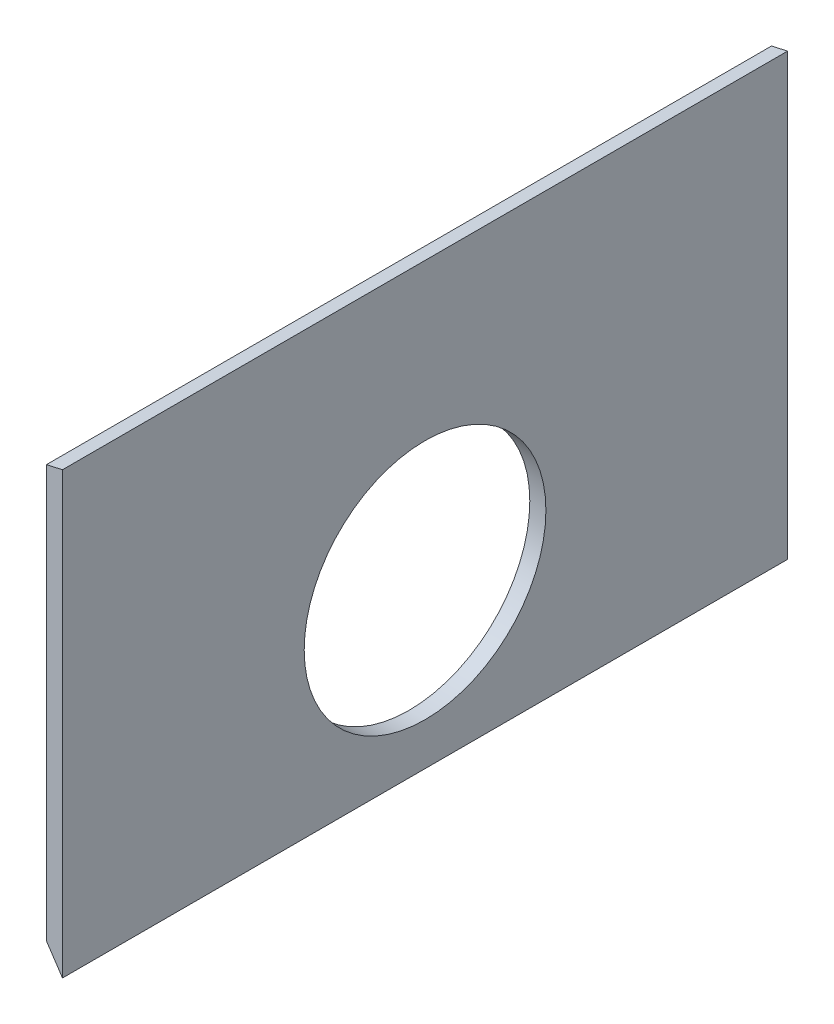
ISO-10303-21;
HEADER;
FILE_DESCRIPTION(('STEP AP214'),'2;1');
FILE_NAME('part.step','',(''),(''),'','','');
FILE_SCHEMA(('AUTOMOTIVE_DESIGN { 1 0 10303 214 1 1 1 1 }'));
ENDSEC;
DATA;
#1=APPLICATION_CONTEXT('core data for automotive mechanical design processes');
#2=APPLICATION_PROTOCOL_DEFINITION('international standard','automotive_design',2000,#1);
#3=PRODUCT_CONTEXT('',#1,'mechanical');
#4=PRODUCT('Part','Part','',(#3));
#5=PRODUCT_RELATED_PRODUCT_CATEGORY('part','',(#4));
#6=PRODUCT_DEFINITION_FORMATION('','',#4);
#7=PRODUCT_DEFINITION_CONTEXT('part definition',#1,'design');
#8=PRODUCT_DEFINITION('design','',#6,#7);
#9=PRODUCT_DEFINITION_SHAPE('','',#8);
#10=(LENGTH_UNIT() NAMED_UNIT(*) SI_UNIT(.MILLI.,.METRE.));
#11=(NAMED_UNIT(*) PLANE_ANGLE_UNIT() SI_UNIT($,.RADIAN.));
#12=(NAMED_UNIT(*) SI_UNIT($,.STERADIAN.) SOLID_ANGLE_UNIT());
#13=UNCERTAINTY_MEASURE_WITH_UNIT(LENGTH_MEASURE(1.E-05),#10,'distance_accuracy_value','');
#14=(GEOMETRIC_REPRESENTATION_CONTEXT(3) GLOBAL_UNCERTAINTY_ASSIGNED_CONTEXT((#13)) GLOBAL_UNIT_ASSIGNED_CONTEXT((#10,
#11,#12)) REPRESENTATION_CONTEXT('',''));
#15=CARTESIAN_POINT('',(0.,0.,0.));
#16=DIRECTION('',(0.,0.,1.));
#17=DIRECTION('',(1.,0.,0.));
#18=AXIS2_PLACEMENT_3D('',#15,#16,#17);
#19=CARTESIAN_POINT('',(341.858259493534,-194.367647058824,450.));
#20=DIRECTION('',(-1.,0.,0.));
#21=DIRECTION('',(0.,-1.,0.));
#22=AXIS2_PLACEMENT_3D('',#19,#20,#21);
#23=PLANE('',#22);
#24=CARTESIAN_POINT('',(341.858259493534,-93.0676470588236,225.));
#25=DIRECTION('',(-1.,0.,0.));
#26=DIRECTION('',(0.,0.,1.));
#27=AXIS2_PLACEMENT_3D('',#24,#25,#26);
#28=CIRCLE('',#27,75.);
#29=CARTESIAN_POINT('',(341.858259493534,-93.0676470588236,300.));
#30=VERTEX_POINT('',#29);
#31=EDGE_CURVE('E99',#30,#30,#28,.T.);
#32=ORIENTED_EDGE('',*,*,#31,.T.);
#33=EDGE_LOOP('',(#32));
#34=FACE_BOUND('',#33,.T.);
#35=DIRECTION('',(0.,1.,0.));
#36=VECTOR('',#35,1.);
#37=CARTESIAN_POINT('',(341.858259493534,-194.367647058824,0.));
#38=LINE('',#37,#36);
#39=CARTESIAN_POINT('',(341.858259493534,-194.367647058824,0.));
#40=VERTEX_POINT('',#39);
#41=CARTESIAN_POINT('',(341.858259493534,78.7945636826585,0.));
#42=VERTEX_POINT('',#41);
#43=EDGE_CURVE('E96',#40,#42,#38,.T.);
#44=ORIENTED_EDGE('',*,*,#43,.T.);
#45=DIRECTION('',(0.,0.,-1.));
#46=VECTOR('',#45,1.);
#47=CARTESIAN_POINT('',(341.858259493534,78.7945636826585,450.));
#48=LINE('',#47,#46);
#49=CARTESIAN_POINT('',(341.858259493534,78.7945636826585,450.));
#50=VERTEX_POINT('',#49);
#51=EDGE_CURVE('E11',#50,#42,#48,.T.);
#52=ORIENTED_EDGE('',*,*,#51,.F.);
#53=DIRECTION('',(0.,1.,0.));
#54=VECTOR('',#53,1.);
#55=CARTESIAN_POINT('',(341.858259493534,-194.367647058824,450.));
#56=LINE('',#55,#54);
#57=CARTESIAN_POINT('',(341.858259493534,-194.367647058824,450.));
#58=VERTEX_POINT('',#57);
#59=EDGE_CURVE('E84',#58,#50,#56,.T.);
#60=ORIENTED_EDGE('',*,*,#59,.F.);
#61=DIRECTION('',(0.,0.,-1.));
#62=VECTOR('',#61,1.);
#63=CARTESIAN_POINT('',(341.858259493534,-194.367647058824,450.));
#64=LINE('',#63,#62);
#65=EDGE_CURVE('E92',#58,#40,#64,.T.);
#66=ORIENTED_EDGE('',*,*,#65,.T.);
#67=EDGE_LOOP('',(#44,#52,#60,#66));
#68=FACE_BOUND('',#67,.T.);
#69=ADVANCED_FACE('F33',(#34,#68),#23,.F.);
#70=CARTESIAN_POINT('',(331.858259493534,76.5236735602839,450.));
#71=DIRECTION('',(0.221450745826469,-0.975171557815803,0.));
#72=DIRECTION('',(0.975171557815803,0.22145074582647,0.));
#73=AXIS2_PLACEMENT_3D('',#70,#71,#72);
#74=PLANE('',#73);
#75=DIRECTION('',(-0.975171557815803,-0.22145074582647,0.));
#76=VECTOR('',#75,1.);
#77=CARTESIAN_POINT('',(331.858259493534,76.5236735602839,0.));
#78=LINE('',#77,#76);
#79=CARTESIAN_POINT('',(331.858259493534,76.5236735602839,0.));
#80=VERTEX_POINT('',#79);
#81=EDGE_CURVE('E88',#42,#80,#78,.T.);
#82=ORIENTED_EDGE('',*,*,#81,.T.);
#83=DIRECTION('',(0.,0.,-1.));
#84=VECTOR('',#83,1.);
#85=CARTESIAN_POINT('',(331.858259493534,76.5236735602839,450.));
#86=LINE('',#85,#84);
#87=CARTESIAN_POINT('',(331.858259493534,76.5236735602839,450.));
#88=VERTEX_POINT('',#87);
#89=EDGE_CURVE('E41',#88,#80,#86,.T.);
#90=ORIENTED_EDGE('',*,*,#89,.F.);
#91=DIRECTION('',(-0.975171557815803,-0.22145074582647,0.));
#92=VECTOR('',#91,1.);
#93=CARTESIAN_POINT('',(331.858259493534,76.5236735602839,450.));
#94=LINE('',#93,#92);
#95=EDGE_CURVE('E79',#50,#88,#94,.T.);
#96=ORIENTED_EDGE('',*,*,#95,.F.);
#97=ORIENTED_EDGE('',*,*,#51,.T.);
#98=EDGE_LOOP('',(#82,#90,#96,#97));
#99=FACE_BOUND('',#98,.T.);
#100=ADVANCED_FACE('F87',(#99),#74,.F.);
#101=CARTESIAN_POINT('',(331.858259493534,76.5236735602839,450.));
#102=DIRECTION('',(1.,0.,0.));
#103=DIRECTION('',(0.,1.,0.));
#104=AXIS2_PLACEMENT_3D('',#101,#102,#103);
#105=PLANE('',#104);
#106=CARTESIAN_POINT('',(331.858259493534,-93.0676470588236,225.));
#107=DIRECTION('',(-1.,0.,0.));
#108=DIRECTION('',(0.,0.,1.));
#109=AXIS2_PLACEMENT_3D('',#106,#107,#108);
#110=CIRCLE('',#109,75.);
#111=CARTESIAN_POINT('',(331.858259493534,-93.0676470588236,300.));
#112=VERTEX_POINT('',#111);
#113=EDGE_CURVE('E112',#112,#112,#110,.T.);
#114=ORIENTED_EDGE('',*,*,#113,.F.);
#115=EDGE_LOOP('',(#114));
#116=FACE_BOUND('',#115,.T.);
#117=DIRECTION('',(0.,-1.,0.));
#118=VECTOR('',#117,1.);
#119=CARTESIAN_POINT('',(331.858259493534,76.5236735602839,0.));
#120=LINE('',#119,#118);
#121=CARTESIAN_POINT('',(331.858259493534,-179.367647058824,0.));
#122=VERTEX_POINT('',#121);
#123=EDGE_CURVE('E66',#80,#122,#120,.T.);
#124=ORIENTED_EDGE('',*,*,#123,.T.);
#125=DIRECTION('',(0.,0.,-1.));
#126=VECTOR('',#125,1.);
#127=CARTESIAN_POINT('',(331.858259493534,-179.367647058824,450.));
#128=LINE('',#127,#126);
#129=CARTESIAN_POINT('',(331.858259493534,-179.367647058824,450.));
#130=VERTEX_POINT('',#129);
#131=EDGE_CURVE('E89',#130,#122,#128,.T.);
#132=ORIENTED_EDGE('',*,*,#131,.F.);
#133=DIRECTION('',(0.,-1.,0.));
#134=VECTOR('',#133,1.);
#135=CARTESIAN_POINT('',(331.858259493534,76.5236735602839,450.));
#136=LINE('',#135,#134);
#137=EDGE_CURVE('E82',#88,#130,#136,.T.);
#138=ORIENTED_EDGE('',*,*,#137,.F.);
#139=ORIENTED_EDGE('',*,*,#89,.T.);
#140=EDGE_LOOP('',(#124,#132,#138,#139));
#141=FACE_BOUND('',#140,.T.);
#142=ADVANCED_FACE('F90',(#116,#141),#105,.F.);
#143=CARTESIAN_POINT('',(331.858259493534,-179.367647058824,450.));
#144=DIRECTION('',(0.832050294337846,0.554700196225225,0.));
#145=DIRECTION('',(-0.554700196225225,0.832050294337847,0.));
#146=AXIS2_PLACEMENT_3D('',#143,#144,#145);
#147=PLANE('',#146);
#148=DIRECTION('',(0.554700196225225,-0.832050294337846,0.));
#149=VECTOR('',#148,1.);
#150=CARTESIAN_POINT('',(331.858259493534,-179.367647058824,0.));
#151=LINE('',#150,#149);
#152=EDGE_CURVE('E72',#122,#40,#151,.T.);
#153=ORIENTED_EDGE('',*,*,#152,.T.);
#154=ORIENTED_EDGE('',*,*,#65,.F.);
#155=DIRECTION('',(0.554700196225225,-0.832050294337846,0.));
#156=VECTOR('',#155,1.);
#157=CARTESIAN_POINT('',(331.858259493534,-179.367647058824,450.));
#158=LINE('',#157,#156);
#159=EDGE_CURVE('E49',#130,#58,#158,.T.);
#160=ORIENTED_EDGE('',*,*,#159,.F.);
#161=ORIENTED_EDGE('',*,*,#131,.T.);
#162=EDGE_LOOP('',(#153,#154,#160,#161));
#163=FACE_BOUND('',#162,.T.);
#164=ADVANCED_FACE('F104',(#163),#147,.F.);
#165=CARTESIAN_POINT('',(0.,0.,450.));
#166=DIRECTION('',(0.,0.,-1.));
#167=DIRECTION('',(-1.,0.,0.));
#168=AXIS2_PLACEMENT_3D('',#165,#166,#167);
#169=PLANE('',#168);
#170=ORIENTED_EDGE('',*,*,#59,.T.);
#171=ORIENTED_EDGE('',*,*,#95,.T.);
#172=ORIENTED_EDGE('',*,*,#137,.T.);
#173=ORIENTED_EDGE('',*,*,#159,.T.);
#174=EDGE_LOOP('',(#170,#171,#172,#173));
#175=FACE_BOUND('',#174,.T.);
#176=ADVANCED_FACE('F80',(#175),#169,.F.);
#177=CARTESIAN_POINT('',(0.,0.,0.));
#178=DIRECTION('',(0.,0.,-1.));
#179=DIRECTION('',(-1.,0.,0.));
#180=AXIS2_PLACEMENT_3D('',#177,#178,#179);
#181=PLANE('',#180);
#182=ORIENTED_EDGE('',*,*,#43,.F.);
#183=ORIENTED_EDGE('',*,*,#152,.F.);
#184=ORIENTED_EDGE('',*,*,#123,.F.);
#185=ORIENTED_EDGE('',*,*,#81,.F.);
#186=EDGE_LOOP('',(#182,#183,#184,#185));
#187=FACE_BOUND('',#186,.T.);
#188=ADVANCED_FACE('F107',(#187),#181,.T.);
#189=CARTESIAN_POINT('',(331.858259493534,-93.0676470588236,225.));
#190=DIRECTION('',(-1.,0.,0.));
#191=DIRECTION('',(0.,0.,1.));
#192=AXIS2_PLACEMENT_3D('',#189,#190,#191);
#193=CYLINDRICAL_SURFACE('',#192,75.);
#194=ORIENTED_EDGE('',*,*,#31,.F.);
#195=EDGE_LOOP('',(#194));
#196=FACE_BOUND('',#195,.T.);
#197=ORIENTED_EDGE('',*,*,#113,.T.);
#198=EDGE_LOOP('',(#197));
#199=FACE_BOUND('',#198,.T.);
#200=ADVANCED_FACE('F116',(#196,#199),#193,.F.);
#201=CLOSED_SHELL('',(#69,#100,#142,#164,#176,#188,#200));
#202=MANIFOLD_SOLID_BREP('B2',#201);
#203=ADVANCED_BREP_SHAPE_REPRESENTATION('',(#18,#202),#14);
#204=SHAPE_DEFINITION_REPRESENTATION(#9,#203);
ENDSEC;
END-ISO-10303-21;
